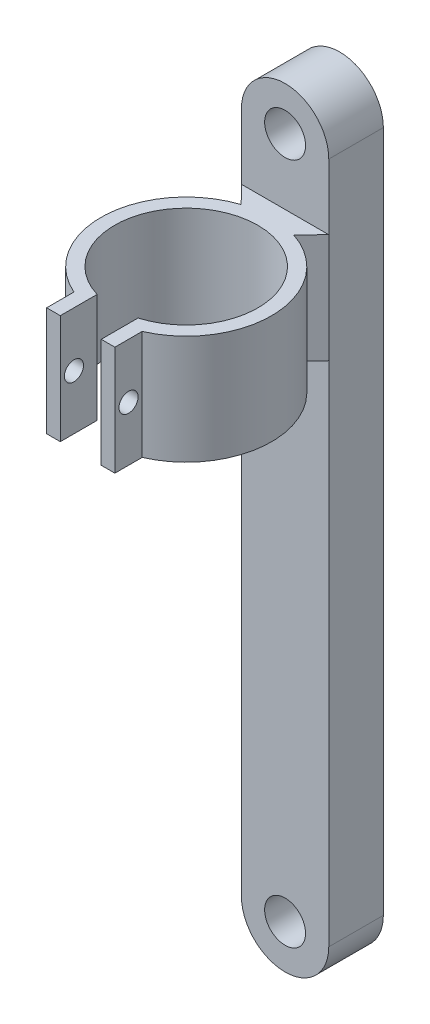
ISO-10303-21;
HEADER;
FILE_DESCRIPTION(('STEP AP214'),'2;1');
FILE_NAME('part.step','',(''),(''),'','','');
FILE_SCHEMA(('AUTOMOTIVE_DESIGN { 1 0 10303 214 1 1 1 1 }'));
ENDSEC;
DATA;
#1=APPLICATION_CONTEXT('core data for automotive mechanical design processes');
#2=APPLICATION_PROTOCOL_DEFINITION('international standard','automotive_design',2000,#1);
#3=PRODUCT_CONTEXT('',#1,'mechanical');
#4=PRODUCT('Part','Part','',(#3));
#5=PRODUCT_RELATED_PRODUCT_CATEGORY('part','',(#4));
#6=PRODUCT_DEFINITION_FORMATION('','',#4);
#7=PRODUCT_DEFINITION_CONTEXT('part definition',#1,'design');
#8=PRODUCT_DEFINITION('design','',#6,#7);
#9=PRODUCT_DEFINITION_SHAPE('','',#8);
#10=(LENGTH_UNIT() NAMED_UNIT(*) SI_UNIT(.MILLI.,.METRE.));
#11=(NAMED_UNIT(*) PLANE_ANGLE_UNIT() SI_UNIT($,.RADIAN.));
#12=(NAMED_UNIT(*) SI_UNIT($,.STERADIAN.) SOLID_ANGLE_UNIT());
#13=UNCERTAINTY_MEASURE_WITH_UNIT(LENGTH_MEASURE(1.E-05),#10,'distance_accuracy_value','');
#14=(GEOMETRIC_REPRESENTATION_CONTEXT(3) GLOBAL_UNCERTAINTY_ASSIGNED_CONTEXT((#13)) GLOBAL_UNIT_ASSIGNED_CONTEXT((#10,
#11,#12)) REPRESENTATION_CONTEXT('',''));
#15=CARTESIAN_POINT('',(0.,0.,0.));
#16=DIRECTION('',(0.,0.,1.));
#17=DIRECTION('',(1.,0.,0.));
#18=AXIS2_PLACEMENT_3D('',#15,#16,#17);
#19=CARTESIAN_POINT('',(-856.488519716724,667.45394098188,376.904950284607));
#20=DIRECTION('',(0.,0.,1.));
#21=DIRECTION('',(1.,0.,0.));
#22=AXIS2_PLACEMENT_3D('',#19,#20,#21);
#23=PLANE('',#22);
#24=CARTESIAN_POINT('',(-856.488519716724,603.95394098188,376.904950284607));
#25=DIRECTION('',(0.,0.,1.));
#26=DIRECTION('',(1.,0.,0.));
#27=AXIS2_PLACEMENT_3D('',#24,#25,#26);
#28=CIRCLE('',#27,1.90500000000005);
#29=CARTESIAN_POINT('',(-854.583519716724,603.95394098188,376.904950284607));
#30=VERTEX_POINT('',#29);
#31=EDGE_CURVE('E327',#30,#30,#28,.T.);
#32=ORIENTED_EDGE('',*,*,#31,.F.);
#33=EDGE_LOOP('',(#32));
#34=FACE_BOUND('',#33,.T.);
#35=DIRECTION('',(0.,1.,0.));
#36=VECTOR('',#35,1.);
#37=CARTESIAN_POINT('',(-852.424519716724,667.45394098188,376.904950284607));
#38=LINE('',#37,#36);
#39=CARTESIAN_POINT('',(-852.424519716724,603.95394098188,376.904950284607));
#40=VERTEX_POINT('',#39);
#41=CARTESIAN_POINT('',(-852.424519716724,651.19794098188,376.904950284608));
#42=VERTEX_POINT('',#41);
#43=EDGE_CURVE('E344',#40,#42,#38,.T.);
#44=ORIENTED_EDGE('',*,*,#43,.T.);
#45=DIRECTION('',(-1.,0.,0.));
#46=VECTOR('',#45,1.);
#47=CARTESIAN_POINT('',(-852.424519716724,651.19794098188,376.904950284608));
#48=LINE('',#47,#46);
#49=CARTESIAN_POINT('',(-860.552519716724,651.19794098188,376.904950284607));
#50=VERTEX_POINT('',#49);
#51=EDGE_CURVE('E232',#42,#50,#48,.T.);
#52=ORIENTED_EDGE('',*,*,#51,.T.);
#53=DIRECTION('',(0.,-1.,0.));
#54=VECTOR('',#53,1.);
#55=CARTESIAN_POINT('',(-860.552519716724,667.45394098188,376.904950284607));
#56=LINE('',#55,#54);
#57=CARTESIAN_POINT('',(-860.552519716724,603.95394098188,376.904950284607));
#58=VERTEX_POINT('',#57);
#59=EDGE_CURVE('E338',#50,#58,#56,.T.);
#60=ORIENTED_EDGE('',*,*,#59,.T.);
#61=CARTESIAN_POINT('',(-856.488519716724,603.95394098188,376.904950284607));
#62=DIRECTION('',(0.,0.,1.));
#63=DIRECTION('',(1.,0.,0.));
#64=AXIS2_PLACEMENT_3D('',#61,#62,#63);
#65=CIRCLE('',#64,4.06400000000001);
#66=EDGE_CURVE('E341',#58,#40,#65,.T.);
#67=ORIENTED_EDGE('',*,*,#66,.T.);
#68=EDGE_LOOP('',(#44,#52,#60,#67));
#69=FACE_BOUND('',#68,.T.);
#70=ADVANCED_FACE('F52',(#34,#69),#23,.T.);
#71=DIRECTION('',(-1.,0.,0.));
#72=VECTOR('',#71,1.);
#73=CARTESIAN_POINT('',(-852.424519716724,661.35794098188,376.904950284608));
#74=LINE('',#73,#72);
#75=CARTESIAN_POINT('',(-852.424519716724,661.35794098188,376.904950284608));
#76=VERTEX_POINT('',#75);
#77=CARTESIAN_POINT('',(-860.552519716724,661.35794098188,376.904950284608));
#78=VERTEX_POINT('',#77);
#79=EDGE_CURVE('E268',#76,#78,#74,.T.);
#80=ORIENTED_EDGE('',*,*,#79,.F.);
#81=CARTESIAN_POINT('',(-852.424519716724,667.45394098188,376.904950284607));
#82=VERTEX_POINT('',#81);
#83=EDGE_CURVE('E78',#76,#82,#38,.T.);
#84=ORIENTED_EDGE('',*,*,#83,.T.);
#85=CARTESIAN_POINT('',(-856.488519716724,667.45394098188,376.904950284607));
#86=DIRECTION('',(0.,0.,1.));
#87=DIRECTION('',(1.,0.,0.));
#88=AXIS2_PLACEMENT_3D('',#85,#86,#87);
#89=CIRCLE('',#88,4.06400000000001);
#90=CARTESIAN_POINT('',(-860.552519716724,667.45394098188,376.904950284607));
#91=VERTEX_POINT('',#90);
#92=EDGE_CURVE('E335',#82,#91,#89,.T.);
#93=ORIENTED_EDGE('',*,*,#92,.T.);
#94=EDGE_CURVE('E107',#91,#78,#56,.T.);
#95=ORIENTED_EDGE('',*,*,#94,.T.);
#96=EDGE_LOOP('',(#80,#84,#93,#95));
#97=FACE_BOUND('',#96,.T.);
#98=CARTESIAN_POINT('',(-856.488519716724,667.45394098188,376.904950284607));
#99=DIRECTION('',(0.,0.,1.));
#100=DIRECTION('',(1.,0.,0.));
#101=AXIS2_PLACEMENT_3D('',#98,#99,#100);
#102=CIRCLE('',#101,1.90500000000002);
#103=CARTESIAN_POINT('',(-854.583519716724,667.45394098188,376.904950284607));
#104=VERTEX_POINT('',#103);
#105=EDGE_CURVE('E319',#104,#104,#102,.T.);
#106=ORIENTED_EDGE('',*,*,#105,.F.);
#107=EDGE_LOOP('',(#106));
#108=FACE_BOUND('',#107,.T.);
#109=ADVANCED_FACE('F427',(#97,#108),#23,.T.);
#110=CARTESIAN_POINT('',(-856.488519716724,667.45394098188,371.824950284607));
#111=DIRECTION('',(0.,0.,1.));
#112=DIRECTION('',(1.,0.,0.));
#113=AXIS2_PLACEMENT_3D('',#110,#111,#112);
#114=PLANE('',#113);
#115=CARTESIAN_POINT('',(-856.488519716724,667.45394098188,371.824950284607));
#116=DIRECTION('',(0.,0.,1.));
#117=DIRECTION('',(1.,0.,0.));
#118=AXIS2_PLACEMENT_3D('',#115,#116,#117);
#119=CIRCLE('',#118,4.06400000000001);
#120=CARTESIAN_POINT('',(-852.424519716724,667.45394098188,371.824950284607));
#121=VERTEX_POINT('',#120);
#122=CARTESIAN_POINT('',(-860.552519716724,667.45394098188,371.824950284607));
#123=VERTEX_POINT('',#122);
#124=EDGE_CURVE('E331',#121,#123,#119,.T.);
#125=ORIENTED_EDGE('',*,*,#124,.F.);
#126=DIRECTION('',(0.,1.,0.));
#127=VECTOR('',#126,1.);
#128=CARTESIAN_POINT('',(-852.424519716724,667.45394098188,371.824950284607));
#129=LINE('',#128,#127);
#130=CARTESIAN_POINT('',(-852.424519716724,603.95394098188,371.824950284607));
#131=VERTEX_POINT('',#130);
#132=EDGE_CURVE('E100',#131,#121,#129,.T.);
#133=ORIENTED_EDGE('',*,*,#132,.F.);
#134=CARTESIAN_POINT('',(-856.488519716724,603.95394098188,371.824950284607));
#135=DIRECTION('',(0.,0.,1.));
#136=DIRECTION('',(1.,0.,0.));
#137=AXIS2_PLACEMENT_3D('',#134,#135,#136);
#138=CIRCLE('',#137,4.06400000000001);
#139=CARTESIAN_POINT('',(-860.552519716724,603.95394098188,371.824950284607));
#140=VERTEX_POINT('',#139);
#141=EDGE_CURVE('E355',#140,#131,#138,.T.);
#142=ORIENTED_EDGE('',*,*,#141,.F.);
#143=DIRECTION('',(0.,-1.,0.));
#144=VECTOR('',#143,1.);
#145=CARTESIAN_POINT('',(-860.552519716724,667.45394098188,371.824950284607));
#146=LINE('',#145,#144);
#147=EDGE_CURVE('E352',#123,#140,#146,.T.);
#148=ORIENTED_EDGE('',*,*,#147,.F.);
#149=EDGE_LOOP('',(#125,#133,#142,#148));
#150=FACE_BOUND('',#149,.T.);
#151=CARTESIAN_POINT('',(-856.488519716724,603.95394098188,371.824950284607));
#152=DIRECTION('',(0.,0.,1.));
#153=DIRECTION('',(1.,0.,0.));
#154=AXIS2_PLACEMENT_3D('',#151,#152,#153);
#155=CIRCLE('',#154,1.90500000000005);
#156=CARTESIAN_POINT('',(-854.583519716724,603.95394098188,371.824950284607));
#157=VERTEX_POINT('',#156);
#158=EDGE_CURVE('E323',#157,#157,#155,.T.);
#159=ORIENTED_EDGE('',*,*,#158,.T.);
#160=EDGE_LOOP('',(#159));
#161=FACE_BOUND('',#160,.T.);
#162=CARTESIAN_POINT('',(-856.488519716724,667.45394098188,371.824950284607));
#163=DIRECTION('',(0.,0.,1.));
#164=DIRECTION('',(1.,0.,0.));
#165=AXIS2_PLACEMENT_3D('',#162,#163,#164);
#166=CIRCLE('',#165,1.90500000000002);
#167=CARTESIAN_POINT('',(-854.583519716724,667.45394098188,371.824950284607));
#168=VERTEX_POINT('',#167);
#169=EDGE_CURVE('E287',#168,#168,#166,.T.);
#170=ORIENTED_EDGE('',*,*,#169,.T.);
#171=EDGE_LOOP('',(#170));
#172=FACE_BOUND('',#171,.T.);
#173=ADVANCED_FACE('F377',(#150,#161,#172),#114,.F.);
#174=CARTESIAN_POINT('',(-856.488519716724,667.45394098188,376.904950284607));
#175=DIRECTION('',(0.,0.,-1.));
#176=DIRECTION('',(-1.,0.,0.));
#177=AXIS2_PLACEMENT_3D('',#174,#175,#176);
#178=CYLINDRICAL_SURFACE('',#177,4.06400000000001);
#179=ORIENTED_EDGE('',*,*,#124,.T.);
#180=DIRECTION('',(0.,0.,-1.));
#181=VECTOR('',#180,1.);
#182=CARTESIAN_POINT('',(-860.552519716724,667.45394098188,376.904950284607));
#183=LINE('',#182,#181);
#184=EDGE_CURVE('E13',#91,#123,#183,.T.);
#185=ORIENTED_EDGE('',*,*,#184,.F.);
#186=ORIENTED_EDGE('',*,*,#92,.F.);
#187=DIRECTION('',(0.,0.,-1.));
#188=VECTOR('',#187,1.);
#189=CARTESIAN_POINT('',(-852.424519716724,667.45394098188,376.904950284607));
#190=LINE('',#189,#188);
#191=EDGE_CURVE('E348',#82,#121,#190,.T.);
#192=ORIENTED_EDGE('',*,*,#191,.T.);
#193=EDGE_LOOP('',(#179,#185,#186,#192));
#194=FACE_BOUND('',#193,.T.);
#195=ADVANCED_FACE('F54',(#194),#178,.T.);
#196=CARTESIAN_POINT('',(-860.552519716724,667.45394098188,376.904950284607));
#197=DIRECTION('',(1.,0.,0.));
#198=DIRECTION('',(0.,0.,-1.));
#199=AXIS2_PLACEMENT_3D('',#196,#197,#198);
#200=PLANE('',#199);
#201=ORIENTED_EDGE('',*,*,#147,.T.);
#202=DIRECTION('',(0.,0.,-1.));
#203=VECTOR('',#202,1.);
#204=CARTESIAN_POINT('',(-860.552519716724,603.95394098188,376.904950284607));
#205=LINE('',#204,#203);
#206=EDGE_CURVE('E62',#58,#140,#205,.T.);
#207=ORIENTED_EDGE('',*,*,#206,.F.);
#208=ORIENTED_EDGE('',*,*,#59,.F.);
#209=DIRECTION('',(0.,1.,0.));
#210=VECTOR('',#209,1.);
#211=CARTESIAN_POINT('',(-860.552519716724,651.19794098188,376.904950284608));
#212=LINE('',#211,#210);
#213=EDGE_CURVE('E299',#50,#78,#212,.T.);
#214=ORIENTED_EDGE('',*,*,#213,.T.);
#215=ORIENTED_EDGE('',*,*,#94,.F.);
#216=ORIENTED_EDGE('',*,*,#184,.T.);
#217=EDGE_LOOP('',(#201,#207,#208,#214,#215,#216));
#218=FACE_BOUND('',#217,.T.);
#219=ADVANCED_FACE('F425',(#218),#200,.F.);
#220=CARTESIAN_POINT('',(-856.488519716724,603.95394098188,376.904950284607));
#221=DIRECTION('',(0.,0.,-1.));
#222=DIRECTION('',(-1.,0.,0.));
#223=AXIS2_PLACEMENT_3D('',#220,#221,#222);
#224=CYLINDRICAL_SURFACE('',#223,4.06400000000001);
#225=ORIENTED_EDGE('',*,*,#141,.T.);
#226=DIRECTION('',(0.,0.,-1.));
#227=VECTOR('',#226,1.);
#228=CARTESIAN_POINT('',(-852.424519716724,603.95394098188,376.904950284607));
#229=LINE('',#228,#227);
#230=EDGE_CURVE('E362',#40,#131,#229,.T.);
#231=ORIENTED_EDGE('',*,*,#230,.F.);
#232=ORIENTED_EDGE('',*,*,#66,.F.);
#233=ORIENTED_EDGE('',*,*,#206,.T.);
#234=EDGE_LOOP('',(#225,#231,#232,#233));
#235=FACE_BOUND('',#234,.T.);
#236=ADVANCED_FACE('F372',(#235),#224,.T.);
#237=CARTESIAN_POINT('',(-852.424519716724,667.45394098188,376.904950284607));
#238=DIRECTION('',(-1.,0.,0.));
#239=DIRECTION('',(0.,0.,1.));
#240=AXIS2_PLACEMENT_3D('',#237,#238,#239);
#241=PLANE('',#240);
#242=ORIENTED_EDGE('',*,*,#132,.T.);
#243=ORIENTED_EDGE('',*,*,#191,.F.);
#244=ORIENTED_EDGE('',*,*,#83,.F.);
#245=DIRECTION('',(0.,1.,0.));
#246=VECTOR('',#245,1.);
#247=CARTESIAN_POINT('',(-852.424519716724,651.19794098188,376.904950284608));
#248=LINE('',#247,#246);
#249=EDGE_CURVE('E302',#42,#76,#248,.T.);
#250=ORIENTED_EDGE('',*,*,#249,.F.);
#251=ORIENTED_EDGE('',*,*,#43,.F.);
#252=ORIENTED_EDGE('',*,*,#230,.T.);
#253=EDGE_LOOP('',(#242,#243,#244,#250,#251,#252));
#254=FACE_BOUND('',#253,.T.);
#255=ADVANCED_FACE('F382',(#254),#241,.F.);
#256=CARTESIAN_POINT('',(-856.488519716724,603.95394098188,376.904950284607));
#257=DIRECTION('',(0.,0.,-1.));
#258=DIRECTION('',(-1.,0.,0.));
#259=AXIS2_PLACEMENT_3D('',#256,#257,#258);
#260=CYLINDRICAL_SURFACE('',#259,1.90500000000005);
#261=ORIENTED_EDGE('',*,*,#31,.T.);
#262=EDGE_LOOP('',(#261));
#263=FACE_BOUND('',#262,.T.);
#264=ORIENTED_EDGE('',*,*,#158,.F.);
#265=EDGE_LOOP('',(#264));
#266=FACE_BOUND('',#265,.T.);
#267=ADVANCED_FACE('F482',(#263,#266),#260,.F.);
#268=CARTESIAN_POINT('',(-856.488519716724,667.45394098188,376.904950284607));
#269=DIRECTION('',(0.,0.,-1.));
#270=DIRECTION('',(-1.,0.,0.));
#271=AXIS2_PLACEMENT_3D('',#268,#269,#270);
#272=CYLINDRICAL_SURFACE('',#271,1.90500000000002);
#273=ORIENTED_EDGE('',*,*,#105,.T.);
#274=EDGE_LOOP('',(#273));
#275=FACE_BOUND('',#274,.T.);
#276=ORIENTED_EDGE('',*,*,#169,.F.);
#277=EDGE_LOOP('',(#276));
#278=FACE_BOUND('',#277,.T.);
#279=ADVANCED_FACE('F613',(#275,#278),#272,.F.);
#280=CARTESIAN_POINT('',(-858.393519716724,651.19794098188,393.814671138835));
#281=DIRECTION('',(-1.,0.,0.));
#282=DIRECTION('',(0.,0.,1.));
#283=AXIS2_PLACEMENT_3D('',#280,#281,#282);
#284=PLANE('',#283);
#285=CARTESIAN_POINT('',(-858.393519716724,656.27794098188,394.654000256387));
#286=DIRECTION('',(-1.,0.,0.));
#287=DIRECTION('',(0.,0.,1.));
#288=AXIS2_PLACEMENT_3D('',#285,#286,#287);
#289=CIRCLE('',#288,0.889000000000054);
#290=CARTESIAN_POINT('',(-858.393519716724,656.27794098188,395.543000256387));
#291=VERTEX_POINT('',#290);
#292=EDGE_CURVE('E212',#291,#291,#289,.T.);
#293=ORIENTED_EDGE('',*,*,#292,.T.);
#294=EDGE_LOOP('',(#293));
#295=FACE_BOUND('',#294,.T.);
#296=DIRECTION('',(0.,0.,1.));
#297=VECTOR('',#296,1.);
#298=CARTESIAN_POINT('',(-858.393519716724,661.35794098188,393.814671138835));
#299=LINE('',#298,#297);
#300=CARTESIAN_POINT('',(-858.393519716724,661.35794098188,392.498725586351));
#301=VERTEX_POINT('',#300);
#302=CARTESIAN_POINT('',(-858.393519716724,661.35794098188,395.924000256388));
#303=VERTEX_POINT('',#302);
#304=EDGE_CURVE('E205',#301,#303,#299,.T.);
#305=ORIENTED_EDGE('',*,*,#304,.T.);
#306=DIRECTION('',(0.,1.,0.));
#307=VECTOR('',#306,1.);
#308=CARTESIAN_POINT('',(-858.393519716724,651.19794098188,395.924000256388));
#309=LINE('',#308,#307);
#310=CARTESIAN_POINT('',(-858.393519716724,651.19794098188,395.924000256388));
#311=VERTEX_POINT('',#310);
#312=EDGE_CURVE('E202',#311,#303,#309,.T.);
#313=ORIENTED_EDGE('',*,*,#312,.F.);
#314=DIRECTION('',(0.,0.,-1.));
#315=VECTOR('',#314,1.);
#316=CARTESIAN_POINT('',(-858.393519716724,651.19794098188,393.814671138835));
#317=LINE('',#316,#315);
#318=CARTESIAN_POINT('',(-858.393519716724,651.19794098188,392.498725586351));
#319=VERTEX_POINT('',#318);
#320=EDGE_CURVE('E193',#311,#319,#317,.T.);
#321=ORIENTED_EDGE('',*,*,#320,.T.);
#322=DIRECTION('',(0.,1.,0.));
#323=VECTOR('',#322,1.);
#324=CARTESIAN_POINT('',(-858.393519716724,651.19794098188,392.498725586351));
#325=LINE('',#324,#323);
#326=EDGE_CURVE('E179',#319,#301,#325,.T.);
#327=ORIENTED_EDGE('',*,*,#326,.T.);
#328=EDGE_LOOP('',(#305,#313,#321,#327));
#329=FACE_BOUND('',#328,.T.);
#330=ADVANCED_FACE('F200',(#295,#329),#284,.F.);
#331=CARTESIAN_POINT('',(-858.393519716724,651.19794098188,395.924000256388));
#332=DIRECTION('',(0.,0.,-1.));
#333=DIRECTION('',(-1.,0.,0.));
#334=AXIS2_PLACEMENT_3D('',#331,#332,#333);
#335=PLANE('',#334);
#336=DIRECTION('',(-1.,0.,0.));
#337=VECTOR('',#336,1.);
#338=CARTESIAN_POINT('',(-858.393519716724,661.35794098188,395.924000256388));
#339=LINE('',#338,#337);
#340=CARTESIAN_POINT('',(-859.663519716724,661.35794098188,395.924000256388));
#341=VERTEX_POINT('',#340);
#342=EDGE_CURVE('E209',#303,#341,#339,.T.);
#343=ORIENTED_EDGE('',*,*,#342,.T.);
#344=DIRECTION('',(0.,1.,0.));
#345=VECTOR('',#344,1.);
#346=CARTESIAN_POINT('',(-859.663519716724,651.19794098188,395.924000256388));
#347=LINE('',#346,#345);
#348=CARTESIAN_POINT('',(-859.663519716724,651.19794098188,395.924000256388));
#349=VERTEX_POINT('',#348);
#350=EDGE_CURVE('E288',#349,#341,#347,.T.);
#351=ORIENTED_EDGE('',*,*,#350,.F.);
#352=DIRECTION('',(-1.,0.,0.));
#353=VECTOR('',#352,1.);
#354=CARTESIAN_POINT('',(-858.393519716724,651.19794098188,395.924000256388));
#355=LINE('',#354,#353);
#356=EDGE_CURVE('E190',#311,#349,#355,.T.);
#357=ORIENTED_EDGE('',*,*,#356,.F.);
#358=ORIENTED_EDGE('',*,*,#312,.T.);
#359=EDGE_LOOP('',(#343,#351,#357,#358));
#360=FACE_BOUND('',#359,.T.);
#361=ADVANCED_FACE('F454',(#360),#335,.F.);
#362=CARTESIAN_POINT('',(-859.663519716724,651.19794098188,395.924000256388));
#363=DIRECTION('',(1.,0.,0.));
#364=DIRECTION('',(0.,0.,-1.));
#365=AXIS2_PLACEMENT_3D('',#362,#363,#364);
#366=PLANE('',#365);
#367=CARTESIAN_POINT('',(-859.663519716724,656.27794098188,394.654000256387));
#368=DIRECTION('',(1.,0.,0.));
#369=DIRECTION('',(0.,0.,-1.));
#370=AXIS2_PLACEMENT_3D('',#367,#368,#369);
#371=CIRCLE('',#370,0.889000000000054);
#372=CARTESIAN_POINT('',(-859.663519716724,656.27794098188,393.765000256387));
#373=VERTEX_POINT('',#372);
#374=EDGE_CURVE('E675',#373,#373,#371,.T.);
#375=ORIENTED_EDGE('',*,*,#374,.T.);
#376=EDGE_LOOP('',(#375));
#377=FACE_BOUND('',#376,.T.);
#378=DIRECTION('',(0.,0.,-1.));
#379=VECTOR('',#378,1.);
#380=CARTESIAN_POINT('',(-859.663519716724,661.35794098188,395.924000256388));
#381=LINE('',#380,#379);
#382=CARTESIAN_POINT('',(-859.663519716724,661.35794098188,393.384000256388));
#383=VERTEX_POINT('',#382);
#384=EDGE_CURVE('E280',#341,#383,#381,.T.);
#385=ORIENTED_EDGE('',*,*,#384,.T.);
#386=DIRECTION('',(0.,1.,0.));
#387=VECTOR('',#386,1.);
#388=CARTESIAN_POINT('',(-859.663519716724,651.19794098188,393.384000256388));
#389=LINE('',#388,#387);
#390=CARTESIAN_POINT('',(-859.663519716724,651.19794098188,393.384000256388));
#391=VERTEX_POINT('',#390);
#392=EDGE_CURVE('E292',#391,#383,#389,.T.);
#393=ORIENTED_EDGE('',*,*,#392,.F.);
#394=DIRECTION('',(0.,0.,-1.));
#395=VECTOR('',#394,1.);
#396=CARTESIAN_POINT('',(-859.663519716724,651.19794098188,395.924000256388));
#397=LINE('',#396,#395);
#398=EDGE_CURVE('E241',#349,#391,#397,.T.);
#399=ORIENTED_EDGE('',*,*,#398,.F.);
#400=ORIENTED_EDGE('',*,*,#350,.T.);
#401=EDGE_LOOP('',(#385,#393,#399,#400));
#402=FACE_BOUND('',#401,.T.);
#403=ADVANCED_FACE('F461',(#377,#402),#366,.F.);
#404=CARTESIAN_POINT('',(-856.488519716724,651.19794098188,386.109161340645));
#405=DIRECTION('',(0.,1.,0.));
#406=DIRECTION('',(0.,0.,1.));
#407=AXIS2_PLACEMENT_3D('',#404,#405,#406);
#408=CYLINDRICAL_SURFACE('',#407,7.93750000000005);
#409=CARTESIAN_POINT('',(-856.488519716724,661.35794098188,386.109161340645));
#410=DIRECTION('',(0.,-1.,0.));
#411=DIRECTION('',(0.,0.,-1.));
#412=AXIS2_PLACEMENT_3D('',#409,#410,#411);
#413=CIRCLE('',#412,7.93750000000005);
#414=CARTESIAN_POINT('',(-858.92528018317,661.35794098188,378.554950284607));
#415=VERTEX_POINT('',#414);
#416=EDGE_CURVE('E276',#383,#415,#413,.T.);
#417=ORIENTED_EDGE('',*,*,#416,.T.);
#418=DIRECTION('',(0.,1.,0.));
#419=VECTOR('',#418,1.);
#420=CARTESIAN_POINT('',(-858.92528018317,651.19794098188,378.554950284607));
#421=LINE('',#420,#419);
#422=CARTESIAN_POINT('',(-858.92528018317,651.19794098188,378.554950284607));
#423=VERTEX_POINT('',#422);
#424=EDGE_CURVE('E296',#423,#415,#421,.T.);
#425=ORIENTED_EDGE('',*,*,#424,.F.);
#426=CARTESIAN_POINT('',(-856.488519716724,651.19794098188,386.109161340645));
#427=DIRECTION('',(0.,-1.,0.));
#428=DIRECTION('',(0.,0.,-1.));
#429=AXIS2_PLACEMENT_3D('',#426,#427,#428);
#430=CIRCLE('',#429,7.93750000000005);
#431=EDGE_CURVE('E238',#391,#423,#430,.T.);
#432=ORIENTED_EDGE('',*,*,#431,.F.);
#433=ORIENTED_EDGE('',*,*,#392,.T.);
#434=EDGE_LOOP('',(#417,#425,#432,#433));
#435=FACE_BOUND('',#434,.T.);
#436=ADVANCED_FACE('F463',(#435),#408,.T.);
#437=CARTESIAN_POINT('',(-860.552519716724,651.19794098188,376.904950284608));
#438=DIRECTION('',(-0.712000475137767,0.,0.702178982456463));
#439=DIRECTION('',(0.702178982456463,0.,0.712000475137767));
#440=AXIS2_PLACEMENT_3D('',#437,#438,#439);
#441=PLANE('',#440);
#442=DIRECTION('',(0.702178982456463,0.,0.712000475137767));
#443=VECTOR('',#442,1.);
#444=CARTESIAN_POINT('',(-860.552519716724,661.35794098188,376.904950284608));
#445=LINE('',#444,#443);
#446=EDGE_CURVE('E272',#78,#415,#445,.T.);
#447=ORIENTED_EDGE('',*,*,#446,.F.);
#448=ORIENTED_EDGE('',*,*,#213,.F.);
#449=DIRECTION('',(0.702178982456463,0.,0.712000475137767));
#450=VECTOR('',#449,1.);
#451=CARTESIAN_POINT('',(-860.552519716724,651.19794098188,376.904950284608));
#452=LINE('',#451,#450);
#453=EDGE_CURVE('E69',#50,#423,#452,.T.);
#454=ORIENTED_EDGE('',*,*,#453,.T.);
#455=ORIENTED_EDGE('',*,*,#424,.T.);
#456=EDGE_LOOP('',(#447,#448,#454,#455));
#457=FACE_BOUND('',#456,.T.);
#458=ADVANCED_FACE('F464',(#457),#441,.T.);
#459=CARTESIAN_POINT('',(-854.051759250277,651.19794098188,378.554950284607));
#460=DIRECTION('',(0.712000475137767,0.,0.702178982456463));
#461=DIRECTION('',(0.702178982456463,0.,-0.712000475137767));
#462=AXIS2_PLACEMENT_3D('',#459,#460,#461);
#463=PLANE('',#462);
#464=DIRECTION('',(0.702178982456463,0.,-0.712000475137767));
#465=VECTOR('',#464,1.);
#466=CARTESIAN_POINT('',(-854.051759250277,661.35794098188,378.554950284607));
#467=LINE('',#466,#465);
#468=CARTESIAN_POINT('',(-854.051759250277,661.35794098188,378.554950284607));
#469=VERTEX_POINT('',#468);
#470=EDGE_CURVE('E264',#469,#76,#467,.T.);
#471=ORIENTED_EDGE('',*,*,#470,.F.);
#472=DIRECTION('',(0.,1.,0.));
#473=VECTOR('',#472,1.);
#474=CARTESIAN_POINT('',(-854.051759250277,651.19794098188,378.554950284607));
#475=LINE('',#474,#473);
#476=CARTESIAN_POINT('',(-854.051759250277,651.19794098188,378.554950284607));
#477=VERTEX_POINT('',#476);
#478=EDGE_CURVE('E305',#477,#469,#475,.T.);
#479=ORIENTED_EDGE('',*,*,#478,.F.);
#480=DIRECTION('',(0.702178982456463,0.,-0.712000475137767));
#481=VECTOR('',#480,1.);
#482=CARTESIAN_POINT('',(-854.051759250277,651.19794098188,378.554950284607));
#483=LINE('',#482,#481);
#484=EDGE_CURVE('E228',#477,#42,#483,.T.);
#485=ORIENTED_EDGE('',*,*,#484,.T.);
#486=ORIENTED_EDGE('',*,*,#249,.T.);
#487=EDGE_LOOP('',(#471,#479,#485,#486));
#488=FACE_BOUND('',#487,.T.);
#489=ADVANCED_FACE('F435',(#488),#463,.T.);
#490=CARTESIAN_POINT('',(-856.488519716724,651.19794098188,386.109161340645));
#491=DIRECTION('',(0.,1.,0.));
#492=DIRECTION('',(0.,0.,1.));
#493=AXIS2_PLACEMENT_3D('',#490,#491,#492);
#494=CYLINDRICAL_SURFACE('',#493,7.93749999999999);
#495=CARTESIAN_POINT('',(-856.488519716724,661.35794098188,386.109161340645));
#496=DIRECTION('',(0.,-1.,0.));
#497=DIRECTION('',(0.,0.,-1.));
#498=AXIS2_PLACEMENT_3D('',#495,#496,#497);
#499=CIRCLE('',#498,7.93749999999999);
#500=CARTESIAN_POINT('',(-853.313519716724,661.35794098188,393.384000256387));
#501=VERTEX_POINT('',#500);
#502=EDGE_CURVE('E260',#469,#501,#499,.T.);
#503=ORIENTED_EDGE('',*,*,#502,.T.);
#504=DIRECTION('',(0.,1.,0.));
#505=VECTOR('',#504,1.);
#506=CARTESIAN_POINT('',(-853.313519716724,651.19794098188,393.384000256387));
#507=LINE('',#506,#505);
#508=CARTESIAN_POINT('',(-853.313519716724,651.19794098188,393.384000256387));
#509=VERTEX_POINT('',#508);
#510=EDGE_CURVE('E308',#509,#501,#507,.T.);
#511=ORIENTED_EDGE('',*,*,#510,.F.);
#512=CARTESIAN_POINT('',(-856.488519716724,651.19794098188,386.109161340645));
#513=DIRECTION('',(0.,-1.,0.));
#514=DIRECTION('',(0.,0.,-1.));
#515=AXIS2_PLACEMENT_3D('',#512,#513,#514);
#516=CIRCLE('',#515,7.93749999999999);
#517=EDGE_CURVE('E225',#477,#509,#516,.T.);
#518=ORIENTED_EDGE('',*,*,#517,.F.);
#519=ORIENTED_EDGE('',*,*,#478,.T.);
#520=EDGE_LOOP('',(#503,#511,#518,#519));
#521=FACE_BOUND('',#520,.T.);
#522=ADVANCED_FACE('F441',(#521),#494,.T.);
#523=CARTESIAN_POINT('',(-853.313519716724,651.19794098188,395.924000256388));
#524=DIRECTION('',(1.,0.,0.));
#525=DIRECTION('',(0.,0.,-1.));
#526=AXIS2_PLACEMENT_3D('',#523,#524,#525);
#527=PLANE('',#526);
#528=CARTESIAN_POINT('',(-853.313519716724,656.27794098188,394.654000256388));
#529=DIRECTION('',(1.,0.,0.));
#530=DIRECTION('',(0.,0.,-1.));
#531=AXIS2_PLACEMENT_3D('',#528,#529,#530);
#532=CIRCLE('',#531,0.889000000000054);
#533=CARTESIAN_POINT('',(-853.313519716724,656.27794098188,393.765000256388));
#534=VERTEX_POINT('',#533);
#535=EDGE_CURVE('E684',#534,#534,#532,.T.);
#536=ORIENTED_EDGE('',*,*,#535,.F.);
#537=EDGE_LOOP('',(#536));
#538=FACE_BOUND('',#537,.T.);
#539=DIRECTION('',(0.,0.,-1.));
#540=VECTOR('',#539,1.);
#541=CARTESIAN_POINT('',(-853.313519716724,661.35794098188,395.924000256388));
#542=LINE('',#541,#540);
#543=CARTESIAN_POINT('',(-853.313519716724,661.35794098188,395.924000256388));
#544=VERTEX_POINT('',#543);
#545=EDGE_CURVE('E256',#544,#501,#542,.T.);
#546=ORIENTED_EDGE('',*,*,#545,.F.);
#547=DIRECTION('',(0.,1.,0.));
#548=VECTOR('',#547,1.);
#549=CARTESIAN_POINT('',(-853.313519716724,651.19794098188,395.924000256388));
#550=LINE('',#549,#548);
#551=CARTESIAN_POINT('',(-853.313519716724,651.19794098188,395.924000256388));
#552=VERTEX_POINT('',#551);
#553=EDGE_CURVE('E311',#552,#544,#550,.T.);
#554=ORIENTED_EDGE('',*,*,#553,.F.);
#555=DIRECTION('',(0.,0.,-1.));
#556=VECTOR('',#555,1.);
#557=CARTESIAN_POINT('',(-853.313519716724,651.19794098188,395.924000256388));
#558=LINE('',#557,#556);
#559=EDGE_CURVE('E221',#552,#509,#558,.T.);
#560=ORIENTED_EDGE('',*,*,#559,.T.);
#561=ORIENTED_EDGE('',*,*,#510,.T.);
#562=EDGE_LOOP('',(#546,#554,#560,#561));
#563=FACE_BOUND('',#562,.T.);
#564=ADVANCED_FACE('F444',(#538,#563),#527,.T.);
#565=CARTESIAN_POINT('',(-854.583519716724,651.19794098188,395.924000256388));
#566=DIRECTION('',(0.,0.,1.));
#567=DIRECTION('',(1.,0.,0.));
#568=AXIS2_PLACEMENT_3D('',#565,#566,#567);
#569=PLANE('',#568);
#570=DIRECTION('',(1.,0.,0.));
#571=VECTOR('',#570,1.);
#572=CARTESIAN_POINT('',(-854.583519716724,661.35794098188,395.924000256388));
#573=LINE('',#572,#571);
#574=CARTESIAN_POINT('',(-854.583519716724,661.35794098188,395.924000256388));
#575=VERTEX_POINT('',#574);
#576=EDGE_CURVE('E252',#575,#544,#573,.T.);
#577=ORIENTED_EDGE('',*,*,#576,.F.);
#578=DIRECTION('',(0.,1.,0.));
#579=VECTOR('',#578,1.);
#580=CARTESIAN_POINT('',(-854.583519716724,651.19794098188,395.924000256388));
#581=LINE('',#580,#579);
#582=CARTESIAN_POINT('',(-854.583519716724,651.19794098188,395.924000256388));
#583=VERTEX_POINT('',#582);
#584=EDGE_CURVE('E314',#583,#575,#581,.T.);
#585=ORIENTED_EDGE('',*,*,#584,.F.);
#586=DIRECTION('',(1.,0.,0.));
#587=VECTOR('',#586,1.);
#588=CARTESIAN_POINT('',(-854.583519716724,651.19794098188,395.924000256388));
#589=LINE('',#588,#587);
#590=EDGE_CURVE('E217',#583,#552,#589,.T.);
#591=ORIENTED_EDGE('',*,*,#590,.T.);
#592=ORIENTED_EDGE('',*,*,#553,.T.);
#593=EDGE_LOOP('',(#577,#585,#591,#592));
#594=FACE_BOUND('',#593,.T.);
#595=ADVANCED_FACE('F447',(#594),#569,.T.);
#596=CARTESIAN_POINT('',(-854.583519716724,651.19794098188,393.814671138835));
#597=DIRECTION('',(-1.,0.,0.));
#598=DIRECTION('',(0.,0.,1.));
#599=AXIS2_PLACEMENT_3D('',#596,#597,#598);
#600=PLANE('',#599);
#601=CARTESIAN_POINT('',(-854.583519716724,656.27794098188,394.654000256387));
#602=DIRECTION('',(-1.,0.,0.));
#603=DIRECTION('',(0.,0.,1.));
#604=AXIS2_PLACEMENT_3D('',#601,#602,#603);
#605=CIRCLE('',#604,0.889000000000054);
#606=CARTESIAN_POINT('',(-854.583519716724,656.27794098188,395.543000256387));
#607=VERTEX_POINT('',#606);
#608=EDGE_CURVE('E56',#607,#607,#605,.T.);
#609=ORIENTED_EDGE('',*,*,#608,.F.);
#610=EDGE_LOOP('',(#609));
#611=FACE_BOUND('',#610,.T.);
#612=DIRECTION('',(0.,0.,1.));
#613=VECTOR('',#612,1.);
#614=CARTESIAN_POINT('',(-854.583519716724,661.35794098188,393.814671138835));
#615=LINE('',#614,#613);
#616=CARTESIAN_POINT('',(-854.583519716724,661.35794098188,392.498725586351));
#617=VERTEX_POINT('',#616);
#618=EDGE_CURVE('E248',#617,#575,#615,.T.);
#619=ORIENTED_EDGE('',*,*,#618,.F.);
#620=DIRECTION('',(0.,1.,0.));
#621=VECTOR('',#620,1.);
#622=CARTESIAN_POINT('',(-854.583519716724,651.19794098188,392.498725586351));
#623=LINE('',#622,#621);
#624=CARTESIAN_POINT('',(-854.583519716724,651.19794098188,392.498725586351));
#625=VERTEX_POINT('',#624);
#626=EDGE_CURVE('E189',#625,#617,#623,.T.);
#627=ORIENTED_EDGE('',*,*,#626,.F.);
#628=DIRECTION('',(0.,0.,-1.));
#629=VECTOR('',#628,1.);
#630=CARTESIAN_POINT('',(-854.583519716724,651.19794098188,393.814671138835));
#631=LINE('',#630,#629);
#632=EDGE_CURVE('E196',#583,#625,#631,.T.);
#633=ORIENTED_EDGE('',*,*,#632,.F.);
#634=ORIENTED_EDGE('',*,*,#584,.T.);
#635=EDGE_LOOP('',(#619,#627,#633,#634));
#636=FACE_BOUND('',#635,.T.);
#637=ADVANCED_FACE('F450',(#611,#636),#600,.T.);
#638=CARTESIAN_POINT('',(-856.488519716724,651.19794098188,386.109161340645));
#639=DIRECTION('',(0.,1.,0.));
#640=DIRECTION('',(0.,0.,1.));
#641=AXIS2_PLACEMENT_3D('',#638,#639,#640);
#642=CYLINDRICAL_SURFACE('',#641,6.66750000000012);
#643=CARTESIAN_POINT('',(-856.488519716724,661.35794098188,386.109161340645));
#644=DIRECTION('',(0.,-1.,0.));
#645=DIRECTION('',(0.,0.,-1.));
#646=AXIS2_PLACEMENT_3D('',#643,#644,#645);
#647=CIRCLE('',#646,6.66750000000012);
#648=EDGE_CURVE('E185',#301,#617,#647,.T.);
#649=ORIENTED_EDGE('',*,*,#648,.F.);
#650=ORIENTED_EDGE('',*,*,#326,.F.);
#651=CARTESIAN_POINT('',(-856.488519716724,651.19794098188,386.109161340645));
#652=DIRECTION('',(0.,-1.,0.));
#653=DIRECTION('',(0.,0.,-1.));
#654=AXIS2_PLACEMENT_3D('',#651,#652,#653);
#655=CIRCLE('',#654,6.66750000000012);
#656=EDGE_CURVE('E183',#319,#625,#655,.T.);
#657=ORIENTED_EDGE('',*,*,#656,.T.);
#658=ORIENTED_EDGE('',*,*,#626,.T.);
#659=EDGE_LOOP('',(#649,#650,#657,#658));
#660=FACE_BOUND('',#659,.T.);
#661=ADVANCED_FACE('F181',(#660),#642,.F.);
#662=CARTESIAN_POINT('',(-856.488519716724,651.19794098188,386.109161340645));
#663=DIRECTION('',(0.,-1.,0.));
#664=DIRECTION('',(0.,0.,-1.));
#665=AXIS2_PLACEMENT_3D('',#662,#663,#664);
#666=PLANE('',#665);
#667=ORIENTED_EDGE('',*,*,#320,.F.);
#668=ORIENTED_EDGE('',*,*,#356,.T.);
#669=ORIENTED_EDGE('',*,*,#398,.T.);
#670=ORIENTED_EDGE('',*,*,#431,.T.);
#671=ORIENTED_EDGE('',*,*,#453,.F.);
#672=ORIENTED_EDGE('',*,*,#51,.F.);
#673=ORIENTED_EDGE('',*,*,#484,.F.);
#674=ORIENTED_EDGE('',*,*,#517,.T.);
#675=ORIENTED_EDGE('',*,*,#559,.F.);
#676=ORIENTED_EDGE('',*,*,#590,.F.);
#677=ORIENTED_EDGE('',*,*,#632,.T.);
#678=ORIENTED_EDGE('',*,*,#656,.F.);
#679=EDGE_LOOP('',(#667,#668,#669,#670,#671,#672,#673,#674,#675,#676,#677,#678));
#680=FACE_BOUND('',#679,.T.);
#681=ADVANCED_FACE('F192',(#680),#666,.T.);
#682=CARTESIAN_POINT('',(-856.488519716724,661.35794098188,386.109161340645));
#683=DIRECTION('',(0.,-1.,0.));
#684=DIRECTION('',(0.,0.,-1.));
#685=AXIS2_PLACEMENT_3D('',#682,#683,#684);
#686=PLANE('',#685);
#687=ORIENTED_EDGE('',*,*,#304,.F.);
#688=ORIENTED_EDGE('',*,*,#648,.T.);
#689=ORIENTED_EDGE('',*,*,#618,.T.);
#690=ORIENTED_EDGE('',*,*,#576,.T.);
#691=ORIENTED_EDGE('',*,*,#545,.T.);
#692=ORIENTED_EDGE('',*,*,#502,.F.);
#693=ORIENTED_EDGE('',*,*,#470,.T.);
#694=ORIENTED_EDGE('',*,*,#79,.T.);
#695=ORIENTED_EDGE('',*,*,#446,.T.);
#696=ORIENTED_EDGE('',*,*,#416,.F.);
#697=ORIENTED_EDGE('',*,*,#384,.F.);
#698=ORIENTED_EDGE('',*,*,#342,.F.);
#699=EDGE_LOOP('',(#687,#688,#689,#690,#691,#692,#693,#694,#695,#696,#697,#698));
#700=FACE_BOUND('',#699,.T.);
#701=ADVANCED_FACE('F430',(#700),#686,.F.);
#702=CARTESIAN_POINT('',(-864.426019716726,656.27794098188,394.654000256387));
#703=DIRECTION('',(1.,0.,0.));
#704=DIRECTION('',(0.,0.,-1.));
#705=AXIS2_PLACEMENT_3D('',#702,#703,#704);
#706=CYLINDRICAL_SURFACE('',#705,0.889000000000054);
#707=ORIENTED_EDGE('',*,*,#608,.T.);
#708=EDGE_LOOP('',(#707));
#709=FACE_BOUND('',#708,.T.);
#710=ORIENTED_EDGE('',*,*,#535,.T.);
#711=EDGE_LOOP('',(#710));
#712=FACE_BOUND('',#711,.T.);
#713=ADVANCED_FACE('F603',(#709,#712),#706,.F.);
#714=ORIENTED_EDGE('',*,*,#374,.F.);
#715=EDGE_LOOP('',(#714));
#716=FACE_BOUND('',#715,.T.);
#717=ORIENTED_EDGE('',*,*,#292,.F.);
#718=EDGE_LOOP('',(#717));
#719=FACE_BOUND('',#718,.T.);
#720=ADVANCED_FACE('F648',(#716,#719),#706,.F.);
#721=CLOSED_SHELL('',(#70,#109,#173,#195,#219,#236,#255,#267,#279,#330,#361,#403,#436,#458,#489,
#522,#564,#595,#637,#661,#681,#701,#713,#720));
#722=MANIFOLD_SOLID_BREP('B2',#721);
#723=ADVANCED_BREP_SHAPE_REPRESENTATION('',(#18,#722),#14);
#724=SHAPE_DEFINITION_REPRESENTATION(#9,#723);
ENDSEC;
END-ISO-10303-21;
